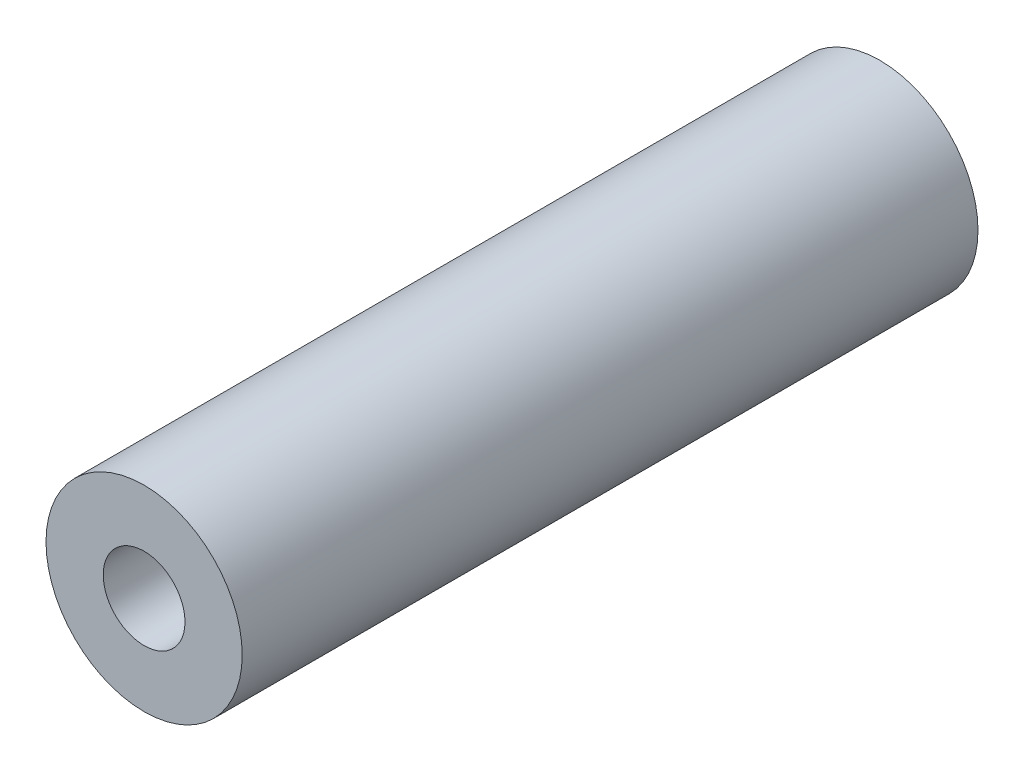
ISO-10303-21;
HEADER;
FILE_DESCRIPTION(('STEP AP214'),'2;1');
FILE_NAME('part.step','',(''),(''),'','','');
FILE_SCHEMA(('AUTOMOTIVE_DESIGN { 1 0 10303 214 1 1 1 1 }'));
ENDSEC;
DATA;
#1=APPLICATION_CONTEXT('core data for automotive mechanical design processes');
#2=APPLICATION_PROTOCOL_DEFINITION('international standard','automotive_design',2000,#1);
#3=PRODUCT_CONTEXT('',#1,'mechanical');
#4=PRODUCT('Part','Part','',(#3));
#5=PRODUCT_RELATED_PRODUCT_CATEGORY('part','',(#4));
#6=PRODUCT_DEFINITION_FORMATION('','',#4);
#7=PRODUCT_DEFINITION_CONTEXT('part definition',#1,'design');
#8=PRODUCT_DEFINITION('design','',#6,#7);
#9=PRODUCT_DEFINITION_SHAPE('','',#8);
#10=(LENGTH_UNIT() NAMED_UNIT(*) SI_UNIT(.MILLI.,.METRE.));
#11=(NAMED_UNIT(*) PLANE_ANGLE_UNIT() SI_UNIT($,.RADIAN.));
#12=(NAMED_UNIT(*) SI_UNIT($,.STERADIAN.) SOLID_ANGLE_UNIT());
#13=UNCERTAINTY_MEASURE_WITH_UNIT(LENGTH_MEASURE(1.E-05),#10,'distance_accuracy_value','');
#14=(GEOMETRIC_REPRESENTATION_CONTEXT(3) GLOBAL_UNCERTAINTY_ASSIGNED_CONTEXT((#13)) GLOBAL_UNIT_ASSIGNED_CONTEXT((#10,
#11,#12)) REPRESENTATION_CONTEXT('',''));
#15=CARTESIAN_POINT('',(0.,0.,0.));
#16=DIRECTION('',(0.,0.,1.));
#17=DIRECTION('',(1.,0.,0.));
#18=AXIS2_PLACEMENT_3D('',#15,#16,#17);
#19=CARTESIAN_POINT('',(0.,0.,0.));
#20=DIRECTION('',(0.,0.,1.));
#21=DIRECTION('',(1.,0.,0.));
#22=AXIS2_PLACEMENT_3D('',#19,#20,#21);
#23=CYLINDRICAL_SURFACE('',#22,2.1);
#24=CARTESIAN_POINT('',(0.,0.,0.));
#25=DIRECTION('',(0.,0.,1.));
#26=DIRECTION('',(1.,0.,0.));
#27=AXIS2_PLACEMENT_3D('',#24,#25,#26);
#28=CIRCLE('',#27,2.1);
#29=CARTESIAN_POINT('',(2.1,0.,0.));
#30=VERTEX_POINT('',#29);
#31=EDGE_CURVE('E46',#30,#30,#28,.T.);
#32=ORIENTED_EDGE('',*,*,#31,.F.);
#33=EDGE_LOOP('',(#32));
#34=FACE_BOUND('',#33,.T.);
#35=CARTESIAN_POINT('',(0.,0.,22.5));
#36=DIRECTION('',(0.,0.,1.));
#37=DIRECTION('',(1.,0.,0.));
#38=AXIS2_PLACEMENT_3D('',#35,#36,#37);
#39=CIRCLE('',#38,2.1);
#40=CARTESIAN_POINT('',(2.1,0.,22.5));
#41=VERTEX_POINT('',#40);
#42=EDGE_CURVE('E50',#41,#41,#39,.F.);
#43=ORIENTED_EDGE('',*,*,#42,.F.);
#44=EDGE_LOOP('',(#43));
#45=FACE_BOUND('',#44,.T.);
#46=ADVANCED_FACE('F33',(#34,#45),#23,.F.);
#47=CARTESIAN_POINT('',(0.,0.,45.));
#48=DIRECTION('',(0.,0.,-1.));
#49=DIRECTION('',(-1.,0.,0.));
#50=AXIS2_PLACEMENT_3D('',#47,#48,#49);
#51=CYLINDRICAL_SURFACE('',#50,6.);
#52=CARTESIAN_POINT('',(0.,0.,45.));
#53=DIRECTION('',(0.,0.,1.));
#54=DIRECTION('',(1.,0.,0.));
#55=AXIS2_PLACEMENT_3D('',#52,#53,#54);
#56=CIRCLE('',#55,6.);
#57=CARTESIAN_POINT('',(6.,0.,45.));
#58=VERTEX_POINT('',#57);
#59=EDGE_CURVE('E10',#58,#58,#56,.T.);
#60=ORIENTED_EDGE('',*,*,#59,.F.);
#61=EDGE_LOOP('',(#60));
#62=FACE_BOUND('',#61,.T.);
#63=CARTESIAN_POINT('',(0.,0.,0.));
#64=DIRECTION('',(0.,0.,1.));
#65=DIRECTION('',(1.,0.,0.));
#66=AXIS2_PLACEMENT_3D('',#63,#64,#65);
#67=CIRCLE('',#66,6.);
#68=CARTESIAN_POINT('',(6.,0.,0.));
#69=VERTEX_POINT('',#68);
#70=EDGE_CURVE('E41',#69,#69,#67,.T.);
#71=ORIENTED_EDGE('',*,*,#70,.T.);
#72=EDGE_LOOP('',(#71));
#73=FACE_BOUND('',#72,.T.);
#74=ADVANCED_FACE('F35',(#62,#73),#51,.T.);
#75=CARTESIAN_POINT('',(0.,0.,45.));
#76=DIRECTION('',(0.,0.,1.));
#77=DIRECTION('',(1.,0.,0.));
#78=AXIS2_PLACEMENT_3D('',#75,#76,#77);
#79=PLANE('',#78);
#80=CARTESIAN_POINT('',(0.,0.,45.));
#81=DIRECTION('',(0.,0.,1.));
#82=DIRECTION('',(1.,0.,0.));
#83=AXIS2_PLACEMENT_3D('',#80,#81,#82);
#84=CIRCLE('',#83,2.5);
#85=CARTESIAN_POINT('',(2.5,0.,45.));
#86=VERTEX_POINT('',#85);
#87=EDGE_CURVE('E37',#86,#86,#84,.T.);
#88=ORIENTED_EDGE('',*,*,#87,.F.);
#89=EDGE_LOOP('',(#88));
#90=FACE_BOUND('',#89,.T.);
#91=ORIENTED_EDGE('',*,*,#59,.T.);
#92=EDGE_LOOP('',(#91));
#93=FACE_BOUND('',#92,.T.);
#94=ADVANCED_FACE('F76',(#90,#93),#79,.T.);
#95=CARTESIAN_POINT('',(0.,0.,0.));
#96=DIRECTION('',(0.,0.,1.));
#97=DIRECTION('',(1.,0.,0.));
#98=AXIS2_PLACEMENT_3D('',#95,#96,#97);
#99=PLANE('',#98);
#100=ORIENTED_EDGE('',*,*,#31,.T.);
#101=EDGE_LOOP('',(#100));
#102=FACE_BOUND('',#101,.T.);
#103=ORIENTED_EDGE('',*,*,#70,.F.);
#104=EDGE_LOOP('',(#103));
#105=FACE_BOUND('',#104,.T.);
#106=ADVANCED_FACE('F68',(#102,#105),#99,.F.);
#107=CARTESIAN_POINT('',(0.,0.,22.5));
#108=DIRECTION('',(0.,0.,1.));
#109=DIRECTION('',(1.,0.,0.));
#110=AXIS2_PLACEMENT_3D('',#107,#108,#109);
#111=PLANE('',#110);
#112=CARTESIAN_POINT('',(0.,0.,22.5));
#113=DIRECTION('',(0.,0.,1.));
#114=DIRECTION('',(1.,0.,0.));
#115=AXIS2_PLACEMENT_3D('',#112,#113,#114);
#116=CIRCLE('',#115,2.5);
#117=CARTESIAN_POINT('',(2.5,0.,22.5));
#118=VERTEX_POINT('',#117);
#119=EDGE_CURVE('E52',#118,#118,#116,.T.);
#120=ORIENTED_EDGE('',*,*,#119,.T.);
#121=EDGE_LOOP('',(#120));
#122=FACE_BOUND('',#121,.T.);
#123=ORIENTED_EDGE('',*,*,#42,.T.);
#124=EDGE_LOOP('',(#123));
#125=FACE_BOUND('',#124,.T.);
#126=ADVANCED_FACE('F59',(#122,#125),#111,.T.);
#127=CARTESIAN_POINT('',(0.,0.,22.5));
#128=DIRECTION('',(0.,0.,1.));
#129=DIRECTION('',(1.,0.,0.));
#130=AXIS2_PLACEMENT_3D('',#127,#128,#129);
#131=CYLINDRICAL_SURFACE('',#130,2.5);
#132=ORIENTED_EDGE('',*,*,#87,.T.);
#133=EDGE_LOOP('',(#132));
#134=FACE_BOUND('',#133,.T.);
#135=ORIENTED_EDGE('',*,*,#119,.F.);
#136=EDGE_LOOP('',(#135));
#137=FACE_BOUND('',#136,.T.);
#138=ADVANCED_FACE('F61',(#134,#137),#131,.F.);
#139=CLOSED_SHELL('',(#46,#74,#94,#106,#126,#138));
#140=MANIFOLD_SOLID_BREP('B2',#139);
#141=ADVANCED_BREP_SHAPE_REPRESENTATION('',(#18,#140),#14);
#142=SHAPE_DEFINITION_REPRESENTATION(#9,#141);
ENDSEC;
END-ISO-10303-21;
